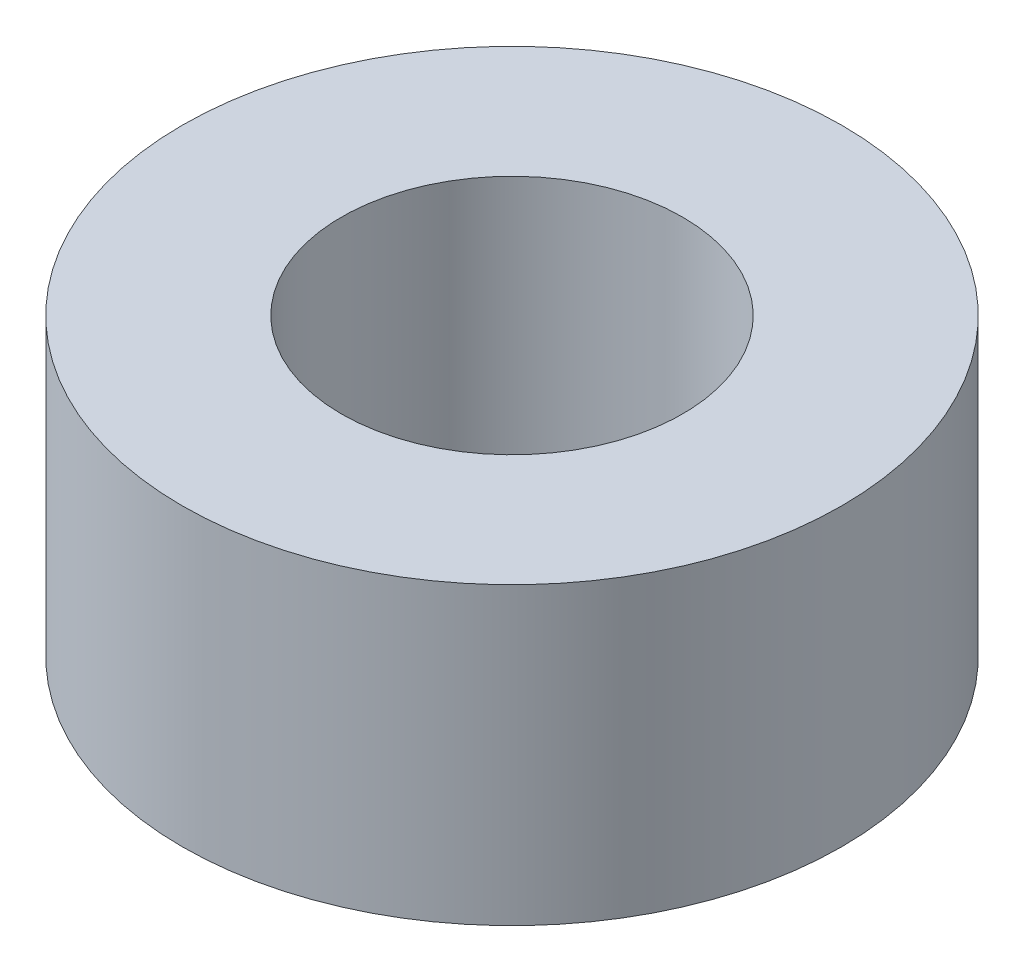
ISO-10303-21;
HEADER;
FILE_DESCRIPTION(('STEP AP214'),'2;1');
FILE_NAME('part.step','',(''),(''),'','','');
FILE_SCHEMA(('AUTOMOTIVE_DESIGN { 1 0 10303 214 1 1 1 1 }'));
ENDSEC;
DATA;
#1=APPLICATION_CONTEXT('core data for automotive mechanical design processes');
#2=APPLICATION_PROTOCOL_DEFINITION('international standard','automotive_design',2000,#1);
#3=PRODUCT_CONTEXT('',#1,'mechanical');
#4=PRODUCT('Part','Part','',(#3));
#5=PRODUCT_RELATED_PRODUCT_CATEGORY('part','',(#4));
#6=PRODUCT_DEFINITION_FORMATION('','',#4);
#7=PRODUCT_DEFINITION_CONTEXT('part definition',#1,'design');
#8=PRODUCT_DEFINITION('design','',#6,#7);
#9=PRODUCT_DEFINITION_SHAPE('','',#8);
#10=(LENGTH_UNIT() NAMED_UNIT(*) SI_UNIT(.MILLI.,.METRE.));
#11=(NAMED_UNIT(*) PLANE_ANGLE_UNIT() SI_UNIT($,.RADIAN.));
#12=(NAMED_UNIT(*) SI_UNIT($,.STERADIAN.) SOLID_ANGLE_UNIT());
#13=UNCERTAINTY_MEASURE_WITH_UNIT(LENGTH_MEASURE(1.E-05),#10,'distance_accuracy_value','');
#14=(GEOMETRIC_REPRESENTATION_CONTEXT(3) GLOBAL_UNCERTAINTY_ASSIGNED_CONTEXT((#13)) GLOBAL_UNIT_ASSIGNED_CONTEXT((#10,
#11,#12)) REPRESENTATION_CONTEXT('',''));
#15=CARTESIAN_POINT('',(0.,0.,0.));
#16=DIRECTION('',(0.,0.,1.));
#17=DIRECTION('',(1.,0.,0.));
#18=AXIS2_PLACEMENT_3D('',#15,#16,#17);
#19=CARTESIAN_POINT('',(0.,8.95591288911823,0.));
#20=DIRECTION('',(0.,-1.,0.));
#21=DIRECTION('',(0.,0.,-1.));
#22=AXIS2_PLACEMENT_3D('',#19,#20,#21);
#23=CYLINDRICAL_SURFACE('',#22,10.);
#24=CARTESIAN_POINT('',(0.,8.95591288911823,0.));
#25=DIRECTION('',(0.,1.,0.));
#26=DIRECTION('',(0.,0.,1.));
#27=AXIS2_PLACEMENT_3D('',#24,#25,#26);
#28=CIRCLE('',#27,10.);
#29=CARTESIAN_POINT('',(0.,8.95591288911823,10.));
#30=VERTEX_POINT('',#29);
#31=EDGE_CURVE('E10',#30,#30,#28,.T.);
#32=ORIENTED_EDGE('',*,*,#31,.F.);
#33=EDGE_LOOP('',(#32));
#34=FACE_BOUND('',#33,.T.);
#35=CARTESIAN_POINT('',(0.,0.,0.));
#36=DIRECTION('',(0.,1.,0.));
#37=DIRECTION('',(0.,0.,1.));
#38=AXIS2_PLACEMENT_3D('',#35,#36,#37);
#39=CIRCLE('',#38,10.);
#40=CARTESIAN_POINT('',(0.,0.,10.));
#41=VERTEX_POINT('',#40);
#42=EDGE_CURVE('E37',#41,#41,#39,.T.);
#43=ORIENTED_EDGE('',*,*,#42,.T.);
#44=EDGE_LOOP('',(#43));
#45=FACE_BOUND('',#44,.T.);
#46=ADVANCED_FACE('F40',(#34,#45),#23,.T.);
#47=CARTESIAN_POINT('',(0.,8.95591288911823,0.));
#48=DIRECTION('',(0.,1.,0.));
#49=DIRECTION('',(0.,0.,1.));
#50=AXIS2_PLACEMENT_3D('',#47,#48,#49);
#51=PLANE('',#50);
#52=CARTESIAN_POINT('',(0.,8.95591288911823,0.));
#53=DIRECTION('',(0.,1.,0.));
#54=DIRECTION('',(0.,0.,1.));
#55=AXIS2_PLACEMENT_3D('',#52,#53,#54);
#56=CIRCLE('',#55,5.17395737091351);
#57=CARTESIAN_POINT('',(0.,8.95591288911823,5.17395737091351));
#58=VERTEX_POINT('',#57);
#59=EDGE_CURVE('E50',#58,#58,#56,.T.);
#60=ORIENTED_EDGE('',*,*,#59,.F.);
#61=EDGE_LOOP('',(#60));
#62=FACE_BOUND('',#61,.T.);
#63=ORIENTED_EDGE('',*,*,#31,.T.);
#64=EDGE_LOOP('',(#63));
#65=FACE_BOUND('',#64,.T.);
#66=ADVANCED_FACE('F59',(#62,#65),#51,.T.);
#67=CARTESIAN_POINT('',(0.,0.,0.));
#68=DIRECTION('',(0.,1.,0.));
#69=DIRECTION('',(0.,0.,1.));
#70=AXIS2_PLACEMENT_3D('',#67,#68,#69);
#71=PLANE('',#70);
#72=CARTESIAN_POINT('',(0.,0.,0.));
#73=DIRECTION('',(0.,1.,0.));
#74=DIRECTION('',(0.,0.,1.));
#75=AXIS2_PLACEMENT_3D('',#72,#73,#74);
#76=CIRCLE('',#75,5.17395737091351);
#77=CARTESIAN_POINT('',(0.,0.,5.17395737091351));
#78=VERTEX_POINT('',#77);
#79=EDGE_CURVE('E47',#78,#78,#76,.T.);
#80=ORIENTED_EDGE('',*,*,#79,.T.);
#81=EDGE_LOOP('',(#80));
#82=FACE_BOUND('',#81,.T.);
#83=ORIENTED_EDGE('',*,*,#42,.F.);
#84=EDGE_LOOP('',(#83));
#85=FACE_BOUND('',#84,.T.);
#86=ADVANCED_FACE('F58',(#82,#85),#71,.F.);
#87=CARTESIAN_POINT('',(0.,8.95591288911823,0.));
#88=DIRECTION('',(0.,-1.,0.));
#89=DIRECTION('',(0.,0.,-1.));
#90=AXIS2_PLACEMENT_3D('',#87,#88,#89);
#91=CYLINDRICAL_SURFACE('',#90,5.17395737091351);
#92=ORIENTED_EDGE('',*,*,#59,.T.);
#93=EDGE_LOOP('',(#92));
#94=FACE_BOUND('',#93,.T.);
#95=ORIENTED_EDGE('',*,*,#79,.F.);
#96=EDGE_LOOP('',(#95));
#97=FACE_BOUND('',#96,.T.);
#98=ADVANCED_FACE('F54',(#94,#97),#91,.F.);
#99=CLOSED_SHELL('',(#46,#66,#86,#98));
#100=MANIFOLD_SOLID_BREP('B2',#99);
#101=ADVANCED_BREP_SHAPE_REPRESENTATION('',(#18,#100),#14);
#102=SHAPE_DEFINITION_REPRESENTATION(#9,#101);
ENDSEC;
END-ISO-10303-21;
